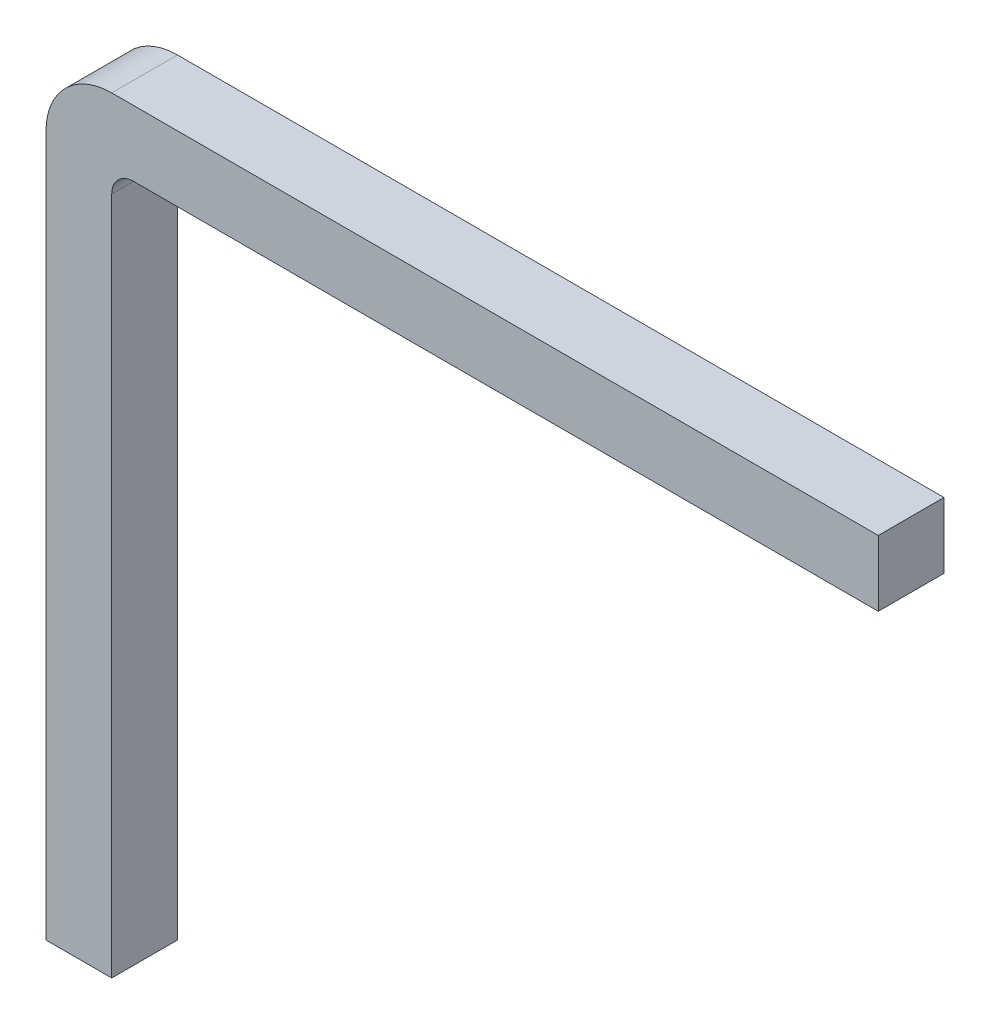
ISO-10303-21;
HEADER;
FILE_DESCRIPTION(('STEP AP214'),'2;1');
FILE_NAME('part.step','',(''),(''),'','','');
FILE_SCHEMA(('AUTOMOTIVE_DESIGN { 1 0 10303 214 1 1 1 1 }'));
ENDSEC;
DATA;
#1=APPLICATION_CONTEXT('core data for automotive mechanical design processes');
#2=APPLICATION_PROTOCOL_DEFINITION('international standard','automotive_design',2000,#1);
#3=PRODUCT_CONTEXT('',#1,'mechanical');
#4=PRODUCT('Part','Part','',(#3));
#5=PRODUCT_RELATED_PRODUCT_CATEGORY('part','',(#4));
#6=PRODUCT_DEFINITION_FORMATION('','',#4);
#7=PRODUCT_DEFINITION_CONTEXT('part definition',#1,'design');
#8=PRODUCT_DEFINITION('design','',#6,#7);
#9=PRODUCT_DEFINITION_SHAPE('','',#8);
#10=(LENGTH_UNIT() NAMED_UNIT(*) SI_UNIT(.MILLI.,.METRE.));
#11=(NAMED_UNIT(*) PLANE_ANGLE_UNIT() SI_UNIT($,.RADIAN.));
#12=(NAMED_UNIT(*) SI_UNIT($,.STERADIAN.) SOLID_ANGLE_UNIT());
#13=UNCERTAINTY_MEASURE_WITH_UNIT(LENGTH_MEASURE(1.E-05),#10,'distance_accuracy_value','');
#14=(GEOMETRIC_REPRESENTATION_CONTEXT(3) GLOBAL_UNCERTAINTY_ASSIGNED_CONTEXT((#13)) GLOBAL_UNIT_ASSIGNED_CONTEXT((#10,
#11,#12)) REPRESENTATION_CONTEXT('',''));
#15=CARTESIAN_POINT('',(0.,0.,0.));
#16=DIRECTION('',(0.,0.,1.));
#17=DIRECTION('',(1.,0.,0.));
#18=AXIS2_PLACEMENT_3D('',#15,#16,#17);
#19=CARTESIAN_POINT('',(0.3,6.2,0.3));
#20=DIRECTION('',(-1.,0.,0.));
#21=DIRECTION('',(0.,-1.,0.));
#22=AXIS2_PLACEMENT_3D('',#19,#20,#21);
#23=PLANE('',#22);
#24=DIRECTION('',(0.,1.,0.));
#25=VECTOR('',#24,1.);
#26=CARTESIAN_POINT('',(0.3,6.2,-0.3));
#27=LINE('',#26,#25);
#28=CARTESIAN_POINT('',(0.3,0.,-0.3));
#29=VERTEX_POINT('',#28);
#30=CARTESIAN_POINT('',(0.3,6.2,-0.3));
#31=VERTEX_POINT('',#30);
#32=EDGE_CURVE('E134',#29,#31,#27,.T.);
#33=ORIENTED_EDGE('',*,*,#32,.T.);
#34=DIRECTION('',(0.,0.,-1.));
#35=VECTOR('',#34,1.);
#36=CARTESIAN_POINT('',(0.3,6.2,0.3));
#37=LINE('',#36,#35);
#38=CARTESIAN_POINT('',(0.3,6.2,0.3));
#39=VERTEX_POINT('',#38);
#40=EDGE_CURVE('E42',#39,#31,#37,.T.);
#41=ORIENTED_EDGE('',*,*,#40,.F.);
#42=DIRECTION('',(0.,1.,0.));
#43=VECTOR('',#42,1.);
#44=CARTESIAN_POINT('',(0.3,6.2,0.3));
#45=LINE('',#44,#43);
#46=CARTESIAN_POINT('',(0.3,0.,0.3));
#47=VERTEX_POINT('',#46);
#48=EDGE_CURVE('E94',#47,#39,#45,.T.);
#49=ORIENTED_EDGE('',*,*,#48,.F.);
#50=DIRECTION('',(0.,0.,-1.));
#51=VECTOR('',#50,1.);
#52=CARTESIAN_POINT('',(0.3,0.,0.3));
#53=LINE('',#52,#51);
#54=EDGE_CURVE('E11',#47,#29,#53,.T.);
#55=ORIENTED_EDGE('',*,*,#54,.T.);
#56=EDGE_LOOP('',(#33,#41,#49,#55));
#57=FACE_BOUND('',#56,.T.);
#58=ADVANCED_FACE('F34',(#57),#23,.F.);
#59=CARTESIAN_POINT('',(0.5,6.2,0.3));
#60=DIRECTION('',(0.,0.,-1.));
#61=DIRECTION('',(-1.,0.,0.));
#62=AXIS2_PLACEMENT_3D('',#59,#60,#61);
#63=CYLINDRICAL_SURFACE('',#62,0.2);
#64=CARTESIAN_POINT('',(0.5,6.2,-0.3));
#65=DIRECTION('',(0.,0.,-1.));
#66=DIRECTION('',(-1.,0.,0.));
#67=AXIS2_PLACEMENT_3D('',#64,#65,#66);
#68=CIRCLE('',#67,0.2);
#69=CARTESIAN_POINT('',(0.500000000000001,6.4,-0.3));
#70=VERTEX_POINT('',#69);
#71=EDGE_CURVE('E136',#31,#70,#68,.T.);
#72=ORIENTED_EDGE('',*,*,#71,.T.);
#73=DIRECTION('',(0.,0.,-1.));
#74=VECTOR('',#73,1.);
#75=CARTESIAN_POINT('',(0.500000000000001,6.4,0.3));
#76=LINE('',#75,#74);
#77=CARTESIAN_POINT('',(0.500000000000001,6.4,0.3));
#78=VERTEX_POINT('',#77);
#79=EDGE_CURVE('E153',#78,#70,#76,.T.);
#80=ORIENTED_EDGE('',*,*,#79,.F.);
#81=CARTESIAN_POINT('',(0.5,6.2,0.3));
#82=DIRECTION('',(0.,0.,-1.));
#83=DIRECTION('',(-1.,0.,0.));
#84=AXIS2_PLACEMENT_3D('',#81,#82,#83);
#85=CIRCLE('',#84,0.2);
#86=EDGE_CURVE('E161',#39,#78,#85,.T.);
#87=ORIENTED_EDGE('',*,*,#86,.F.);
#88=ORIENTED_EDGE('',*,*,#40,.T.);
#89=EDGE_LOOP('',(#72,#80,#87,#88));
#90=FACE_BOUND('',#89,.T.);
#91=ADVANCED_FACE('F159',(#90),#63,.F.);
#92=CARTESIAN_POINT('',(7.3,6.4,0.3));
#93=DIRECTION('',(0.,1.,0.));
#94=DIRECTION('',(-1.,0.,0.));
#95=AXIS2_PLACEMENT_3D('',#92,#93,#94);
#96=PLANE('',#95);
#97=DIRECTION('',(1.,0.,0.));
#98=VECTOR('',#97,1.);
#99=CARTESIAN_POINT('',(7.3,6.4,-0.3));
#100=LINE('',#99,#98);
#101=CARTESIAN_POINT('',(7.3,6.4,-0.3));
#102=VERTEX_POINT('',#101);
#103=EDGE_CURVE('E138',#70,#102,#100,.T.);
#104=ORIENTED_EDGE('',*,*,#103,.T.);
#105=DIRECTION('',(0.,0.,-1.));
#106=VECTOR('',#105,1.);
#107=CARTESIAN_POINT('',(7.3,6.4,0.3));
#108=LINE('',#107,#106);
#109=CARTESIAN_POINT('',(7.3,6.4,0.3));
#110=VERTEX_POINT('',#109);
#111=EDGE_CURVE('E150',#110,#102,#108,.T.);
#112=ORIENTED_EDGE('',*,*,#111,.F.);
#113=DIRECTION('',(1.,0.,0.));
#114=VECTOR('',#113,1.);
#115=CARTESIAN_POINT('',(7.3,6.4,0.3));
#116=LINE('',#115,#114);
#117=EDGE_CURVE('E174',#78,#110,#116,.T.);
#118=ORIENTED_EDGE('',*,*,#117,.F.);
#119=ORIENTED_EDGE('',*,*,#79,.T.);
#120=EDGE_LOOP('',(#104,#112,#118,#119));
#121=FACE_BOUND('',#120,.T.);
#122=ADVANCED_FACE('F170',(#121),#96,.F.);
#123=CARTESIAN_POINT('',(7.3,7.,0.3));
#124=DIRECTION('',(-1.,0.,0.));
#125=DIRECTION('',(0.,-1.,0.));
#126=AXIS2_PLACEMENT_3D('',#123,#124,#125);
#127=PLANE('',#126);
#128=DIRECTION('',(0.,1.,0.));
#129=VECTOR('',#128,1.);
#130=CARTESIAN_POINT('',(7.3,7.,-0.3));
#131=LINE('',#130,#129);
#132=CARTESIAN_POINT('',(7.3,7.,-0.3));
#133=VERTEX_POINT('',#132);
#134=EDGE_CURVE('E140',#102,#133,#131,.T.);
#135=ORIENTED_EDGE('',*,*,#134,.T.);
#136=DIRECTION('',(0.,0.,-1.));
#137=VECTOR('',#136,1.);
#138=CARTESIAN_POINT('',(7.3,7.,0.3));
#139=LINE('',#138,#137);
#140=CARTESIAN_POINT('',(7.3,7.,0.3));
#141=VERTEX_POINT('',#140);
#142=EDGE_CURVE('E123',#141,#133,#139,.T.);
#143=ORIENTED_EDGE('',*,*,#142,.F.);
#144=DIRECTION('',(0.,1.,0.));
#145=VECTOR('',#144,1.);
#146=CARTESIAN_POINT('',(7.3,7.,0.3));
#147=LINE('',#146,#145);
#148=EDGE_CURVE('E114',#110,#141,#147,.T.);
#149=ORIENTED_EDGE('',*,*,#148,.F.);
#150=ORIENTED_EDGE('',*,*,#111,.T.);
#151=EDGE_LOOP('',(#135,#143,#149,#150));
#152=FACE_BOUND('',#151,.T.);
#153=ADVANCED_FACE('F173',(#152),#127,.F.);
#154=CARTESIAN_POINT('',(0.300000000000005,7.,0.3));
#155=DIRECTION('',(0.,-1.,0.));
#156=DIRECTION('',(0.,0.,-1.));
#157=AXIS2_PLACEMENT_3D('',#154,#155,#156);
#158=PLANE('',#157);
#159=DIRECTION('',(-1.,0.,0.));
#160=VECTOR('',#159,1.);
#161=CARTESIAN_POINT('',(0.300000000000005,7.,-0.3));
#162=LINE('',#161,#160);
#163=CARTESIAN_POINT('',(0.300000000000005,7.,-0.3));
#164=VERTEX_POINT('',#163);
#165=EDGE_CURVE('E122',#133,#164,#162,.T.);
#166=ORIENTED_EDGE('',*,*,#165,.T.);
#167=DIRECTION('',(0.,0.,-1.));
#168=VECTOR('',#167,1.);
#169=CARTESIAN_POINT('',(0.300000000000005,7.,0.3));
#170=LINE('',#169,#168);
#171=CARTESIAN_POINT('',(0.300000000000005,7.,0.3));
#172=VERTEX_POINT('',#171);
#173=EDGE_CURVE('E119',#172,#164,#170,.T.);
#174=ORIENTED_EDGE('',*,*,#173,.F.);
#175=DIRECTION('',(-1.,0.,0.));
#176=VECTOR('',#175,1.);
#177=CARTESIAN_POINT('',(0.300000000000005,7.,0.3));
#178=LINE('',#177,#176);
#179=EDGE_CURVE('E108',#141,#172,#178,.T.);
#180=ORIENTED_EDGE('',*,*,#179,.F.);
#181=ORIENTED_EDGE('',*,*,#142,.T.);
#182=EDGE_LOOP('',(#166,#174,#180,#181));
#183=FACE_BOUND('',#182,.T.);
#184=ADVANCED_FACE('F120',(#183),#158,.F.);
#185=CARTESIAN_POINT('',(0.300000000000001,6.4,0.3));
#186=DIRECTION('',(0.,0.,-1.));
#187=DIRECTION('',(-1.,0.,0.));
#188=AXIS2_PLACEMENT_3D('',#185,#186,#187);
#189=CYLINDRICAL_SURFACE('',#188,0.6);
#190=CARTESIAN_POINT('',(0.300000000000001,6.4,-0.3));
#191=DIRECTION('',(0.,0.,1.));
#192=DIRECTION('',(-1.,0.,0.));
#193=AXIS2_PLACEMENT_3D('',#190,#191,#192);
#194=CIRCLE('',#193,0.6);
#195=CARTESIAN_POINT('',(-0.299999999999999,6.4,-0.3));
#196=VERTEX_POINT('',#195);
#197=EDGE_CURVE('E80',#164,#196,#194,.T.);
#198=ORIENTED_EDGE('',*,*,#197,.T.);
#199=DIRECTION('',(0.,0.,-1.));
#200=VECTOR('',#199,1.);
#201=CARTESIAN_POINT('',(-0.299999999999999,6.4,0.3));
#202=LINE('',#201,#200);
#203=CARTESIAN_POINT('',(-0.299999999999999,6.4,0.3));
#204=VERTEX_POINT('',#203);
#205=EDGE_CURVE('E124',#204,#196,#202,.T.);
#206=ORIENTED_EDGE('',*,*,#205,.F.);
#207=CARTESIAN_POINT('',(0.300000000000001,6.4,0.3));
#208=DIRECTION('',(0.,0.,1.));
#209=DIRECTION('',(-1.,0.,0.));
#210=AXIS2_PLACEMENT_3D('',#207,#208,#209);
#211=CIRCLE('',#210,0.6);
#212=EDGE_CURVE('E112',#172,#204,#211,.T.);
#213=ORIENTED_EDGE('',*,*,#212,.F.);
#214=ORIENTED_EDGE('',*,*,#173,.T.);
#215=EDGE_LOOP('',(#198,#206,#213,#214));
#216=FACE_BOUND('',#215,.T.);
#217=ADVANCED_FACE('F126',(#216),#189,.T.);
#218=CARTESIAN_POINT('',(-0.3,0.,0.3));
#219=DIRECTION('',(1.,0.,0.));
#220=DIRECTION('',(0.,1.,0.));
#221=AXIS2_PLACEMENT_3D('',#218,#219,#220);
#222=PLANE('',#221);
#223=DIRECTION('',(0.,-1.,0.));
#224=VECTOR('',#223,1.);
#225=CARTESIAN_POINT('',(-0.3,0.,-0.3));
#226=LINE('',#225,#224);
#227=CARTESIAN_POINT('',(-0.3,0.,-0.3));
#228=VERTEX_POINT('',#227);
#229=EDGE_CURVE('E87',#196,#228,#226,.T.);
#230=ORIENTED_EDGE('',*,*,#229,.T.);
#231=DIRECTION('',(0.,0.,-1.));
#232=VECTOR('',#231,1.);
#233=CARTESIAN_POINT('',(-0.3,0.,0.3));
#234=LINE('',#233,#232);
#235=CARTESIAN_POINT('',(-0.3,0.,0.3));
#236=VERTEX_POINT('',#235);
#237=EDGE_CURVE('E130',#236,#228,#234,.T.);
#238=ORIENTED_EDGE('',*,*,#237,.F.);
#239=DIRECTION('',(0.,-1.,0.));
#240=VECTOR('',#239,1.);
#241=CARTESIAN_POINT('',(-0.3,0.,0.3));
#242=LINE('',#241,#240);
#243=EDGE_CURVE('E128',#204,#236,#242,.T.);
#244=ORIENTED_EDGE('',*,*,#243,.F.);
#245=ORIENTED_EDGE('',*,*,#205,.T.);
#246=EDGE_LOOP('',(#230,#238,#244,#245));
#247=FACE_BOUND('',#246,.T.);
#248=ADVANCED_FACE('F195',(#247),#222,.F.);
#249=CARTESIAN_POINT('',(0.,0.,0.3));
#250=DIRECTION('',(0.,1.,0.));
#251=DIRECTION('',(-1.,0.,0.));
#252=AXIS2_PLACEMENT_3D('',#249,#250,#251);
#253=PLANE('',#252);
#254=DIRECTION('',(1.,0.,0.));
#255=VECTOR('',#254,1.);
#256=CARTESIAN_POINT('',(0.,0.,-0.3));
#257=LINE('',#256,#255);
#258=EDGE_CURVE('E145',#228,#29,#257,.T.);
#259=ORIENTED_EDGE('',*,*,#258,.T.);
#260=ORIENTED_EDGE('',*,*,#54,.F.);
#261=DIRECTION('',(1.,0.,0.));
#262=VECTOR('',#261,1.);
#263=CARTESIAN_POINT('',(0.3,0.,0.3));
#264=LINE('',#263,#262);
#265=EDGE_CURVE('E50',#236,#47,#264,.T.);
#266=ORIENTED_EDGE('',*,*,#265,.F.);
#267=ORIENTED_EDGE('',*,*,#237,.T.);
#268=EDGE_LOOP('',(#259,#260,#266,#267));
#269=FACE_BOUND('',#268,.T.);
#270=ADVANCED_FACE('F179',(#269),#253,.F.);
#271=CARTESIAN_POINT('',(0.300000000000001,6.4,0.3));
#272=DIRECTION('',(0.,0.,-1.));
#273=DIRECTION('',(-1.,0.,0.));
#274=AXIS2_PLACEMENT_3D('',#271,#272,#273);
#275=PLANE('',#274);
#276=ORIENTED_EDGE('',*,*,#265,.T.);
#277=ORIENTED_EDGE('',*,*,#48,.T.);
#278=ORIENTED_EDGE('',*,*,#86,.T.);
#279=ORIENTED_EDGE('',*,*,#117,.T.);
#280=ORIENTED_EDGE('',*,*,#148,.T.);
#281=ORIENTED_EDGE('',*,*,#179,.T.);
#282=ORIENTED_EDGE('',*,*,#212,.T.);
#283=ORIENTED_EDGE('',*,*,#243,.T.);
#284=EDGE_LOOP('',(#276,#277,#278,#279,#280,#281,#282,#283));
#285=FACE_BOUND('',#284,.T.);
#286=ADVANCED_FACE('F110',(#285),#275,.F.);
#287=CARTESIAN_POINT('',(0.300000000000001,6.4,-0.3));
#288=DIRECTION('',(0.,0.,-1.));
#289=DIRECTION('',(-1.,0.,0.));
#290=AXIS2_PLACEMENT_3D('',#287,#288,#289);
#291=PLANE('',#290);
#292=ORIENTED_EDGE('',*,*,#32,.F.);
#293=ORIENTED_EDGE('',*,*,#258,.F.);
#294=ORIENTED_EDGE('',*,*,#229,.F.);
#295=ORIENTED_EDGE('',*,*,#197,.F.);
#296=ORIENTED_EDGE('',*,*,#165,.F.);
#297=ORIENTED_EDGE('',*,*,#134,.F.);
#298=ORIENTED_EDGE('',*,*,#103,.F.);
#299=ORIENTED_EDGE('',*,*,#71,.F.);
#300=EDGE_LOOP('',(#292,#293,#294,#295,#296,#297,#298,#299));
#301=FACE_BOUND('',#300,.T.);
#302=ADVANCED_FACE('F165',(#301),#291,.T.);
#303=CLOSED_SHELL('',(#58,#91,#122,#153,#184,#217,#248,#270,#286,#302));
#304=MANIFOLD_SOLID_BREP('B2',#303);
#305=ADVANCED_BREP_SHAPE_REPRESENTATION('',(#18,#304),#14);
#306=SHAPE_DEFINITION_REPRESENTATION(#9,#305);
ENDSEC;
END-ISO-10303-21;
